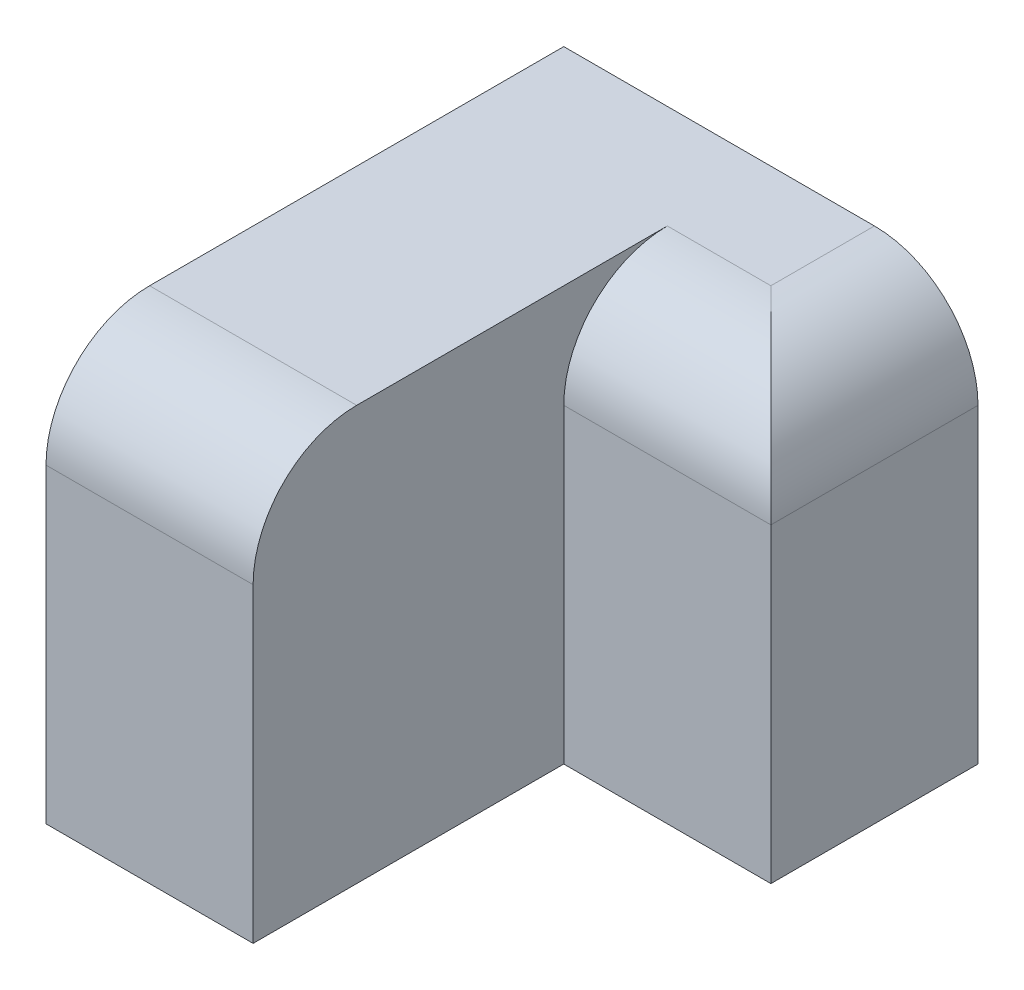
ISO-10303-21;
HEADER;
FILE_DESCRIPTION(('STEP AP214'),'2;1');
FILE_NAME('part.step','',(''),(''),'','','');
FILE_SCHEMA(('AUTOMOTIVE_DESIGN { 1 0 10303 214 1 1 1 1 }'));
ENDSEC;
DATA;
#1=APPLICATION_CONTEXT('core data for automotive mechanical design processes');
#2=APPLICATION_PROTOCOL_DEFINITION('international standard','automotive_design',2000,#1);
#3=PRODUCT_CONTEXT('',#1,'mechanical');
#4=PRODUCT('Part','Part','',(#3));
#5=PRODUCT_RELATED_PRODUCT_CATEGORY('part','',(#4));
#6=PRODUCT_DEFINITION_FORMATION('','',#4);
#7=PRODUCT_DEFINITION_CONTEXT('part definition',#1,'design');
#8=PRODUCT_DEFINITION('design','',#6,#7);
#9=PRODUCT_DEFINITION_SHAPE('','',#8);
#10=(LENGTH_UNIT() NAMED_UNIT(*) SI_UNIT(.MILLI.,.METRE.));
#11=(NAMED_UNIT(*) PLANE_ANGLE_UNIT() SI_UNIT($,.RADIAN.));
#12=(NAMED_UNIT(*) SI_UNIT($,.STERADIAN.) SOLID_ANGLE_UNIT());
#13=UNCERTAINTY_MEASURE_WITH_UNIT(LENGTH_MEASURE(1.E-05),#10,'distance_accuracy_value','');
#14=(GEOMETRIC_REPRESENTATION_CONTEXT(3) GLOBAL_UNCERTAINTY_ASSIGNED_CONTEXT((#13)) GLOBAL_UNIT_ASSIGNED_CONTEXT((#10,
#11,#12)) REPRESENTATION_CONTEXT('',''));
#15=CARTESIAN_POINT('',(0.,0.,0.));
#16=DIRECTION('',(0.,0.,1.));
#17=DIRECTION('',(1.,0.,0.));
#18=AXIS2_PLACEMENT_3D('',#15,#16,#17);
#19=CARTESIAN_POINT('',(-10.,0.,30.));
#20=DIRECTION('',(0.,-1.,0.));
#21=DIRECTION('',(1.,0.,0.));
#22=AXIS2_PLACEMENT_3D('',#19,#20,#21);
#23=PLANE('',#22);
#24=DIRECTION('',(0.,0.,-1.));
#25=VECTOR('',#24,1.);
#26=CARTESIAN_POINT('',(-10.,0.,30.));
#27=LINE('',#26,#25);
#28=CARTESIAN_POINT('',(-10.,0.,20.));
#29=VERTEX_POINT('',#28);
#30=CARTESIAN_POINT('',(-10.,0.,-10.));
#31=VERTEX_POINT('',#30);
#32=EDGE_CURVE('E150',#29,#31,#27,.T.);
#33=ORIENTED_EDGE('',*,*,#32,.T.);
#34=DIRECTION('',(-1.,0.,0.));
#35=VECTOR('',#34,1.);
#36=CARTESIAN_POINT('',(10.,0.,-10.));
#37=LINE('',#36,#35);
#38=CARTESIAN_POINT('',(0.,0.,-10.));
#39=VERTEX_POINT('',#38);
#40=EDGE_CURVE('E163',#31,#39,#37,.F.);
#41=ORIENTED_EDGE('',*,*,#40,.T.);
#42=DIRECTION('',(0.,0.,1.));
#43=VECTOR('',#42,1.);
#44=CARTESIAN_POINT('',(0.,0.,-20.));
#45=LINE('',#44,#43);
#46=CARTESIAN_POINT('',(0.,0.,-20.));
#47=VERTEX_POINT('',#46);
#48=EDGE_CURVE('E120',#39,#47,#45,.F.);
#49=ORIENTED_EDGE('',*,*,#48,.T.);
#50=DIRECTION('',(-1.,0.,0.));
#51=VECTOR('',#50,1.);
#52=CARTESIAN_POINT('',(10.,0.,-20.));
#53=LINE('',#52,#51);
#54=CARTESIAN_POINT('',(-30.,0.,-20.));
#55=VERTEX_POINT('',#54);
#56=EDGE_CURVE('E118',#47,#55,#53,.T.);
#57=ORIENTED_EDGE('',*,*,#56,.T.);
#58=DIRECTION('',(0.,0.,-1.));
#59=VECTOR('',#58,1.);
#60=CARTESIAN_POINT('',(-30.,0.,30.));
#61=LINE('',#60,#59);
#62=CARTESIAN_POINT('',(-30.,0.,20.));
#63=VERTEX_POINT('',#62);
#64=EDGE_CURVE('E106',#63,#55,#61,.T.);
#65=ORIENTED_EDGE('',*,*,#64,.F.);
#66=DIRECTION('',(-1.,0.,0.));
#67=VECTOR('',#66,1.);
#68=CARTESIAN_POINT('',(-10.,0.,20.));
#69=LINE('',#68,#67);
#70=EDGE_CURVE('E160',#63,#29,#69,.F.);
#71=ORIENTED_EDGE('',*,*,#70,.T.);
#72=EDGE_LOOP('',(#33,#41,#49,#57,#65,#71));
#73=FACE_BOUND('',#72,.T.);
#74=ADVANCED_FACE('F35',(#73),#23,.F.);
#75=CARTESIAN_POINT('',(-30.,0.,30.));
#76=DIRECTION('',(1.,0.,0.));
#77=DIRECTION('',(0.,0.,-1.));
#78=AXIS2_PLACEMENT_3D('',#75,#76,#77);
#79=PLANE('',#78);
#80=DIRECTION('',(0.,-1.,0.));
#81=VECTOR('',#80,1.);
#82=CARTESIAN_POINT('',(-30.,0.,30.));
#83=LINE('',#82,#81);
#84=CARTESIAN_POINT('',(-30.,-10.,30.));
#85=VERTEX_POINT('',#84);
#86=CARTESIAN_POINT('',(-30.,-40.,30.));
#87=VERTEX_POINT('',#86);
#88=EDGE_CURVE('E144',#85,#87,#83,.T.);
#89=ORIENTED_EDGE('',*,*,#88,.F.);
#90=CARTESIAN_POINT('',(-30.,-10.,20.));
#91=DIRECTION('',(1.,0.,0.));
#92=DIRECTION('',(0.,0.,-1.));
#93=AXIS2_PLACEMENT_3D('',#90,#91,#92);
#94=CIRCLE('',#93,10.);
#95=EDGE_CURVE('E58',#85,#63,#94,.F.);
#96=ORIENTED_EDGE('',*,*,#95,.T.);
#97=ORIENTED_EDGE('',*,*,#64,.T.);
#98=DIRECTION('',(0.,-1.,0.));
#99=VECTOR('',#98,1.);
#100=CARTESIAN_POINT('',(-30.,0.,-20.));
#101=LINE('',#100,#99);
#102=CARTESIAN_POINT('',(-30.,-40.,-20.));
#103=VERTEX_POINT('',#102);
#104=EDGE_CURVE('E112',#55,#103,#101,.T.);
#105=ORIENTED_EDGE('',*,*,#104,.T.);
#106=DIRECTION('',(0.,0.,-1.));
#107=VECTOR('',#106,1.);
#108=CARTESIAN_POINT('',(-30.,-40.,30.));
#109=LINE('',#108,#107);
#110=EDGE_CURVE('E115',#87,#103,#109,.T.);
#111=ORIENTED_EDGE('',*,*,#110,.F.);
#112=EDGE_LOOP('',(#89,#96,#97,#105,#111));
#113=FACE_BOUND('',#112,.T.);
#114=ADVANCED_FACE('F109',(#113),#79,.F.);
#115=CARTESIAN_POINT('',(-30.,-40.,30.));
#116=DIRECTION('',(0.,1.,0.));
#117=DIRECTION('',(0.,0.,1.));
#118=AXIS2_PLACEMENT_3D('',#115,#116,#117);
#119=PLANE('',#118);
#120=ORIENTED_EDGE('',*,*,#110,.T.);
#121=DIRECTION('',(1.,0.,0.));
#122=VECTOR('',#121,1.);
#123=CARTESIAN_POINT('',(-30.,-40.,-20.));
#124=LINE('',#123,#122);
#125=CARTESIAN_POINT('',(10.,-40.,-20.));
#126=VERTEX_POINT('',#125);
#127=EDGE_CURVE('E129',#103,#126,#124,.T.);
#128=ORIENTED_EDGE('',*,*,#127,.T.);
#129=DIRECTION('',(0.,0.,1.));
#130=VECTOR('',#129,1.);
#131=CARTESIAN_POINT('',(10.,-40.,-20.));
#132=LINE('',#131,#130);
#133=CARTESIAN_POINT('',(10.,-40.,0.));
#134=VERTEX_POINT('',#133);
#135=EDGE_CURVE('E136',#126,#134,#132,.T.);
#136=ORIENTED_EDGE('',*,*,#135,.T.);
#137=DIRECTION('',(1.,0.,0.));
#138=VECTOR('',#137,1.);
#139=CARTESIAN_POINT('',(-30.,-40.,0.));
#140=LINE('',#139,#138);
#141=CARTESIAN_POINT('',(-10.,-40.,0.));
#142=VERTEX_POINT('',#141);
#143=EDGE_CURVE('E137',#142,#134,#140,.T.);
#144=ORIENTED_EDGE('',*,*,#143,.F.);
#145=DIRECTION('',(0.,0.,-1.));
#146=VECTOR('',#145,1.);
#147=CARTESIAN_POINT('',(-10.,-40.,30.));
#148=LINE('',#147,#146);
#149=CARTESIAN_POINT('',(-10.,-40.,30.));
#150=VERTEX_POINT('',#149);
#151=EDGE_CURVE('E154',#150,#142,#148,.T.);
#152=ORIENTED_EDGE('',*,*,#151,.F.);
#153=DIRECTION('',(1.,0.,0.));
#154=VECTOR('',#153,1.);
#155=CARTESIAN_POINT('',(-30.,-40.,30.));
#156=LINE('',#155,#154);
#157=EDGE_CURVE('E146',#87,#150,#156,.T.);
#158=ORIENTED_EDGE('',*,*,#157,.F.);
#159=EDGE_LOOP('',(#120,#128,#136,#144,#152,#158));
#160=FACE_BOUND('',#159,.T.);
#161=ADVANCED_FACE('F177',(#160),#119,.F.);
#162=CARTESIAN_POINT('',(-10.,-40.,30.));
#163=DIRECTION('',(-1.,0.,0.));
#164=DIRECTION('',(0.,0.,1.));
#165=AXIS2_PLACEMENT_3D('',#162,#163,#164);
#166=PLANE('',#165);
#167=ORIENTED_EDGE('',*,*,#32,.F.);
#168=CARTESIAN_POINT('',(-10.,-10.,20.));
#169=DIRECTION('',(-1.,0.,0.));
#170=DIRECTION('',(0.,0.,1.));
#171=AXIS2_PLACEMENT_3D('',#168,#169,#170);
#172=CIRCLE('',#171,10.);
#173=CARTESIAN_POINT('',(-10.,-10.,30.));
#174=VERTEX_POINT('',#173);
#175=EDGE_CURVE('E44',#29,#174,#172,.F.);
#176=ORIENTED_EDGE('',*,*,#175,.T.);
#177=DIRECTION('',(0.,1.,0.));
#178=VECTOR('',#177,1.);
#179=CARTESIAN_POINT('',(-10.,-40.,30.));
#180=LINE('',#179,#178);
#181=EDGE_CURVE('E148',#150,#174,#180,.T.);
#182=ORIENTED_EDGE('',*,*,#181,.F.);
#183=ORIENTED_EDGE('',*,*,#151,.T.);
#184=DIRECTION('',(0.,1.,0.));
#185=VECTOR('',#184,1.);
#186=CARTESIAN_POINT('',(-10.,-40.,0.));
#187=LINE('',#186,#185);
#188=CARTESIAN_POINT('',(-10.,-10.,0.));
#189=VERTEX_POINT('',#188);
#190=EDGE_CURVE('E143',#142,#189,#187,.T.);
#191=ORIENTED_EDGE('',*,*,#190,.T.);
#192=CARTESIAN_POINT('',(-10.,-10.,-10.));
#193=DIRECTION('',(-1.,0.,0.));
#194=DIRECTION('',(0.,0.,1.));
#195=AXIS2_PLACEMENT_3D('',#192,#193,#194);
#196=CIRCLE('',#195,10.);
#197=EDGE_CURVE('E11',#189,#31,#196,.T.);
#198=ORIENTED_EDGE('',*,*,#197,.T.);
#199=EDGE_LOOP('',(#167,#176,#182,#183,#191,#198));
#200=FACE_BOUND('',#199,.T.);
#201=ADVANCED_FACE('F179',(#200),#166,.F.);
#202=CARTESIAN_POINT('',(0.,0.,30.));
#203=DIRECTION('',(0.,0.,1.));
#204=DIRECTION('',(1.,0.,0.));
#205=AXIS2_PLACEMENT_3D('',#202,#203,#204);
#206=PLANE('',#205);
#207=ORIENTED_EDGE('',*,*,#181,.T.);
#208=DIRECTION('',(-1.,0.,0.));
#209=VECTOR('',#208,1.);
#210=CARTESIAN_POINT('',(-30.,-10.,30.));
#211=LINE('',#210,#209);
#212=EDGE_CURVE('E169',#174,#85,#211,.T.);
#213=ORIENTED_EDGE('',*,*,#212,.T.);
#214=ORIENTED_EDGE('',*,*,#88,.T.);
#215=ORIENTED_EDGE('',*,*,#157,.T.);
#216=EDGE_LOOP('',(#207,#213,#214,#215));
#217=FACE_BOUND('',#216,.T.);
#218=ADVANCED_FACE('F173',(#217),#206,.T.);
#219=CARTESIAN_POINT('',(0.,0.,0.));
#220=DIRECTION('',(0.,0.,1.));
#221=DIRECTION('',(1.,0.,0.));
#222=AXIS2_PLACEMENT_3D('',#219,#220,#221);
#223=PLANE('',#222);
#224=DIRECTION('',(0.,1.,0.));
#225=VECTOR('',#224,1.);
#226=CARTESIAN_POINT('',(10.,-40.,0.));
#227=LINE('',#226,#225);
#228=CARTESIAN_POINT('',(10.,-10.,0.));
#229=VERTEX_POINT('',#228);
#230=EDGE_CURVE('E123',#134,#229,#227,.T.);
#231=ORIENTED_EDGE('',*,*,#230,.T.);
#232=DIRECTION('',(-1.,0.,0.));
#233=VECTOR('',#232,1.);
#234=CARTESIAN_POINT('',(-10.,-10.,0.));
#235=LINE('',#234,#233);
#236=EDGE_CURVE('E114',#229,#189,#235,.T.);
#237=ORIENTED_EDGE('',*,*,#236,.T.);
#238=ORIENTED_EDGE('',*,*,#190,.F.);
#239=ORIENTED_EDGE('',*,*,#143,.T.);
#240=EDGE_LOOP('',(#231,#237,#238,#239));
#241=FACE_BOUND('',#240,.T.);
#242=ADVANCED_FACE('F186',(#241),#223,.T.);
#243=CARTESIAN_POINT('',(10.,-40.,-20.));
#244=DIRECTION('',(1.,0.,0.));
#245=DIRECTION('',(0.,0.,-1.));
#246=AXIS2_PLACEMENT_3D('',#243,#244,#245);
#247=PLANE('',#246);
#248=DIRECTION('',(0.,1.,0.));
#249=VECTOR('',#248,1.);
#250=CARTESIAN_POINT('',(10.,-40.,-20.));
#251=LINE('',#250,#249);
#252=CARTESIAN_POINT('',(10.,-10.,-20.));
#253=VERTEX_POINT('',#252);
#254=EDGE_CURVE('E131',#126,#253,#251,.T.);
#255=ORIENTED_EDGE('',*,*,#254,.T.);
#256=DIRECTION('',(0.,0.,1.));
#257=VECTOR('',#256,1.);
#258=CARTESIAN_POINT('',(10.,-10.,0.));
#259=LINE('',#258,#257);
#260=EDGE_CURVE('E165',#253,#229,#259,.T.);
#261=ORIENTED_EDGE('',*,*,#260,.T.);
#262=ORIENTED_EDGE('',*,*,#230,.F.);
#263=ORIENTED_EDGE('',*,*,#135,.F.);
#264=EDGE_LOOP('',(#255,#261,#262,#263));
#265=FACE_BOUND('',#264,.T.);
#266=ADVANCED_FACE('F205',(#265),#247,.T.);
#267=CARTESIAN_POINT('',(0.,0.,-20.));
#268=DIRECTION('',(0.,0.,1.));
#269=DIRECTION('',(1.,0.,0.));
#270=AXIS2_PLACEMENT_3D('',#267,#268,#269);
#271=PLANE('',#270);
#272=ORIENTED_EDGE('',*,*,#56,.F.);
#273=CARTESIAN_POINT('',(0.,-10.,-20.));
#274=DIRECTION('',(0.,0.,1.));
#275=DIRECTION('',(1.,0.,0.));
#276=AXIS2_PLACEMENT_3D('',#273,#274,#275);
#277=CIRCLE('',#276,10.);
#278=EDGE_CURVE('E167',#47,#253,#277,.F.);
#279=ORIENTED_EDGE('',*,*,#278,.T.);
#280=ORIENTED_EDGE('',*,*,#254,.F.);
#281=ORIENTED_EDGE('',*,*,#127,.F.);
#282=ORIENTED_EDGE('',*,*,#104,.F.);
#283=EDGE_LOOP('',(#272,#279,#280,#281,#282));
#284=FACE_BOUND('',#283,.T.);
#285=ADVANCED_FACE('F126',(#284),#271,.F.);
#286=CARTESIAN_POINT('',(0.,-10.,-20.));
#287=DIRECTION('',(0.,0.,-1.));
#288=DIRECTION('',(-1.,0.,0.));
#289=AXIS2_PLACEMENT_3D('',#286,#287,#288);
#290=CYLINDRICAL_SURFACE('',#289,10.);
#291=ORIENTED_EDGE('',*,*,#278,.F.);
#292=ORIENTED_EDGE('',*,*,#48,.F.);
#293=CARTESIAN_POINT('',(0.,-10.,-10.));
#294=DIRECTION('',(0.707106781186547,0.,-0.707106781186547));
#295=DIRECTION('',(-0.707106781186547,0.,-0.707106781186547));
#296=AXIS2_PLACEMENT_3D('',#293,#294,#295);
#297=ELLIPSE('',#296,14.1421356237309,10.);
#298=EDGE_CURVE('E39',#229,#39,#297,.F.);
#299=ORIENTED_EDGE('',*,*,#298,.F.);
#300=ORIENTED_EDGE('',*,*,#260,.F.);
#301=EDGE_LOOP('',(#291,#292,#299,#300));
#302=FACE_BOUND('',#301,.T.);
#303=ADVANCED_FACE('F198',(#302),#290,.T.);
#304=CARTESIAN_POINT('',(0.,-10.,-10.));
#305=DIRECTION('',(1.,0.,0.));
#306=DIRECTION('',(0.,1.,0.));
#307=AXIS2_PLACEMENT_3D('',#304,#305,#306);
#308=CYLINDRICAL_SURFACE('',#307,10.);
#309=ORIENTED_EDGE('',*,*,#298,.T.);
#310=ORIENTED_EDGE('',*,*,#40,.F.);
#311=ORIENTED_EDGE('',*,*,#197,.F.);
#312=ORIENTED_EDGE('',*,*,#236,.F.);
#313=EDGE_LOOP('',(#309,#310,#311,#312));
#314=FACE_BOUND('',#313,.T.);
#315=ADVANCED_FACE('F196',(#314),#308,.T.);
#316=CARTESIAN_POINT('',(0.,-10.,20.));
#317=DIRECTION('',(1.,0.,0.));
#318=DIRECTION('',(0.,1.,0.));
#319=AXIS2_PLACEMENT_3D('',#316,#317,#318);
#320=CYLINDRICAL_SURFACE('',#319,10.);
#321=ORIENTED_EDGE('',*,*,#175,.F.);
#322=ORIENTED_EDGE('',*,*,#70,.F.);
#323=ORIENTED_EDGE('',*,*,#95,.F.);
#324=ORIENTED_EDGE('',*,*,#212,.F.);
#325=EDGE_LOOP('',(#321,#322,#323,#324));
#326=FACE_BOUND('',#325,.T.);
#327=ADVANCED_FACE('F37',(#326),#320,.T.);
#328=CLOSED_SHELL('',(#74,#114,#161,#201,#218,#242,#266,#285,#303,#315,#327));
#329=MANIFOLD_SOLID_BREP('B2',#328);
#330=ADVANCED_BREP_SHAPE_REPRESENTATION('',(#18,#329),#14);
#331=SHAPE_DEFINITION_REPRESENTATION(#9,#330);
ENDSEC;
END-ISO-10303-21;
